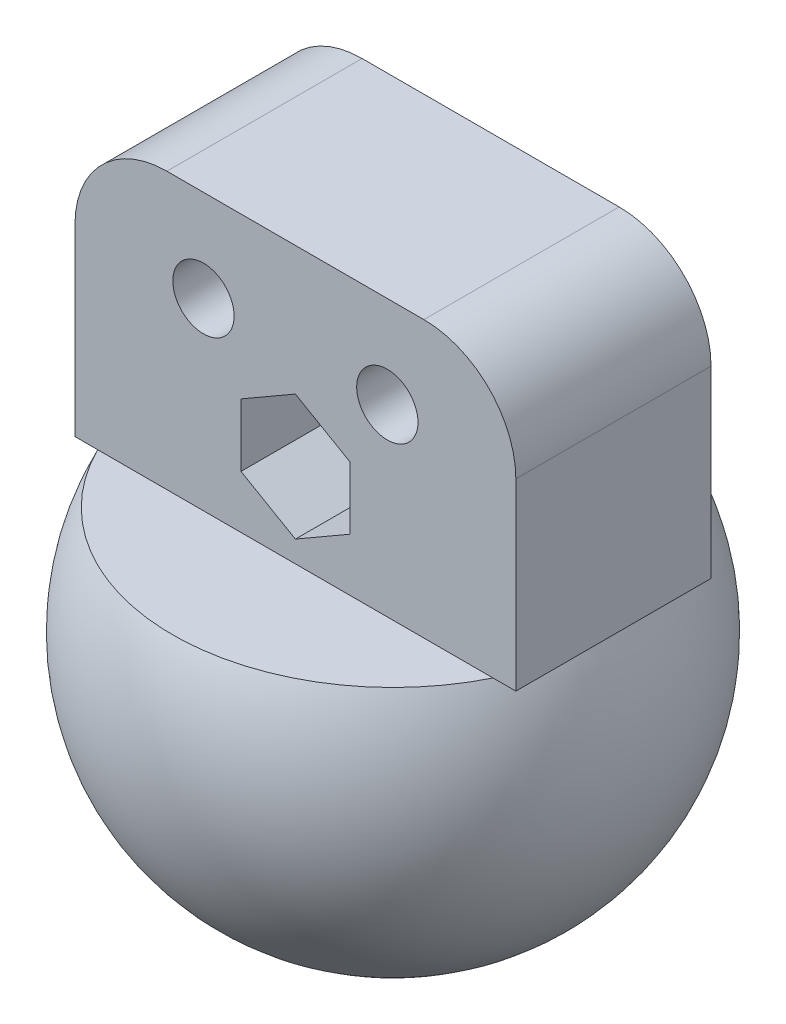
ISO-10303-21;
HEADER;
FILE_DESCRIPTION(('STEP AP214'),'2;1');
FILE_NAME('part.step','',(''),(''),'','','');
FILE_SCHEMA(('AUTOMOTIVE_DESIGN { 1 0 10303 214 1 1 1 1 }'));
ENDSEC;
DATA;
#1=APPLICATION_CONTEXT('core data for automotive mechanical design processes');
#2=APPLICATION_PROTOCOL_DEFINITION('international standard','automotive_design',2000,#1);
#3=PRODUCT_CONTEXT('',#1,'mechanical');
#4=PRODUCT('Part','Part','',(#3));
#5=PRODUCT_RELATED_PRODUCT_CATEGORY('part','',(#4));
#6=PRODUCT_DEFINITION_FORMATION('','',#4);
#7=PRODUCT_DEFINITION_CONTEXT('part definition',#1,'design');
#8=PRODUCT_DEFINITION('design','',#6,#7);
#9=PRODUCT_DEFINITION_SHAPE('','',#8);
#10=(LENGTH_UNIT() NAMED_UNIT(*) SI_UNIT(.MILLI.,.METRE.));
#11=(NAMED_UNIT(*) PLANE_ANGLE_UNIT() SI_UNIT($,.RADIAN.));
#12=(NAMED_UNIT(*) SI_UNIT($,.STERADIAN.) SOLID_ANGLE_UNIT());
#13=UNCERTAINTY_MEASURE_WITH_UNIT(LENGTH_MEASURE(1.E-05),#10,'distance_accuracy_value','');
#14=(GEOMETRIC_REPRESENTATION_CONTEXT(3) GLOBAL_UNCERTAINTY_ASSIGNED_CONTEXT((#13)) GLOBAL_UNIT_ASSIGNED_CONTEXT((#10,
#11,#12)) REPRESENTATION_CONTEXT('',''));
#15=CARTESIAN_POINT('',(0.,0.,0.));
#16=DIRECTION('',(0.,0.,1.));
#17=DIRECTION('',(1.,0.,0.));
#18=AXIS2_PLACEMENT_3D('',#15,#16,#17);
#19=CARTESIAN_POINT('',(0.,0.,0.));
#20=DIRECTION('',(0.,1.,0.));
#21=DIRECTION('',(1.,0.,0.));
#22=AXIS2_PLACEMENT_3D('',#19,#20,#21);
#23=SPHERICAL_SURFACE('',#22,16.);
#24=CARTESIAN_POINT('',(0.,7.,0.));
#25=DIRECTION('',(0.,1.,0.));
#26=DIRECTION('',(0.,0.,1.));
#27=AXIS2_PLACEMENT_3D('',#24,#25,#26);
#28=CIRCLE('',#27,14.3874945699382);
#29=CARTESIAN_POINT('',(-12.9005077419457,7.,-6.37));
#30=VERTEX_POINT('',#29);
#31=CARTESIAN_POINT('',(-14.3874945699382,7.,0.));
#32=VERTEX_POINT('',#31);
#33=EDGE_CURVE('E364',#30,#32,#28,.T.);
#34=ORIENTED_EDGE('',*,*,#33,.F.);
#35=CARTESIAN_POINT('',(0.,7.,0.));
#36=DIRECTION('',(0.,-1.,0.));
#37=DIRECTION('',(0.,0.,-1.));
#38=AXIS2_PLACEMENT_3D('',#35,#36,#37);
#39=CIRCLE('',#38,14.3874945699382);
#40=CARTESIAN_POINT('',(12.9005077419457,7.,-6.37));
#41=VERTEX_POINT('',#40);
#42=EDGE_CURVE('E199',#41,#30,#39,.F.);
#43=ORIENTED_EDGE('',*,*,#42,.F.);
#44=CARTESIAN_POINT('',(14.3874945699382,7.,0.));
#45=VERTEX_POINT('',#44);
#46=EDGE_CURVE('E276',#45,#41,#28,.T.);
#47=ORIENTED_EDGE('',*,*,#46,.F.);
#48=CARTESIAN_POINT('',(12.9005077419457,7.,6.37));
#49=VERTEX_POINT('',#48);
#50=EDGE_CURVE('E279',#49,#45,#28,.T.);
#51=ORIENTED_EDGE('',*,*,#50,.F.);
#52=CARTESIAN_POINT('',(0.,7.,0.));
#53=DIRECTION('',(0.,1.,0.));
#54=DIRECTION('',(0.,0.,1.));
#55=AXIS2_PLACEMENT_3D('',#52,#53,#54);
#56=CIRCLE('',#55,14.3874945699382);
#57=CARTESIAN_POINT('',(-12.9005077419457,7.,6.37));
#58=VERTEX_POINT('',#57);
#59=EDGE_CURVE('E209',#49,#58,#56,.F.);
#60=ORIENTED_EDGE('',*,*,#59,.T.);
#61=EDGE_CURVE('E280',#32,#58,#28,.T.);
#62=ORIENTED_EDGE('',*,*,#61,.F.);
#63=EDGE_LOOP('',(#34,#43,#47,#51,#60,#62));
#64=FACE_BOUND('',#63,.T.);
#65=ADVANCED_FACE('F62',(#64),#23,.T.);
#66=CARTESIAN_POINT('',(-14.3874945699382,7.,6.37));
#67=DIRECTION('',(0.,1.,0.));
#68=DIRECTION('',(0.,0.,1.));
#69=AXIS2_PLACEMENT_3D('',#66,#67,#68);
#70=PLANE('',#69);
#71=DIRECTION('',(1.,0.,0.));
#72=VECTOR('',#71,1.);
#73=CARTESIAN_POINT('',(-14.3874945699382,7.,6.37));
#74=LINE('',#73,#72);
#75=CARTESIAN_POINT('',(14.3874945699382,7.,6.37));
#76=VERTEX_POINT('',#75);
#77=EDGE_CURVE('E249',#49,#76,#74,.T.);
#78=ORIENTED_EDGE('',*,*,#77,.F.);
#79=ORIENTED_EDGE('',*,*,#50,.T.);
#80=DIRECTION('',(0.,0.,-1.));
#81=VECTOR('',#80,1.);
#82=CARTESIAN_POINT('',(14.3874945699382,7.,6.37));
#83=LINE('',#82,#81);
#84=EDGE_CURVE('E269',#76,#45,#83,.T.);
#85=ORIENTED_EDGE('',*,*,#84,.F.);
#86=EDGE_LOOP('',(#78,#79,#85));
#87=FACE_BOUND('',#86,.T.);
#88=ADVANCED_FACE('F325',(#87),#70,.F.);
#89=CARTESIAN_POINT('',(14.3874945699382,7.,-6.37));
#90=VERTEX_POINT('',#89);
#91=EDGE_CURVE('E259',#45,#90,#83,.T.);
#92=ORIENTED_EDGE('',*,*,#91,.F.);
#93=ORIENTED_EDGE('',*,*,#46,.T.);
#94=DIRECTION('',(1.,0.,0.));
#95=VECTOR('',#94,1.);
#96=CARTESIAN_POINT('',(-14.3874945699382,7.,-6.37));
#97=LINE('',#96,#95);
#98=EDGE_CURVE('E261',#41,#90,#97,.T.);
#99=ORIENTED_EDGE('',*,*,#98,.T.);
#100=EDGE_LOOP('',(#92,#93,#99));
#101=FACE_BOUND('',#100,.T.);
#102=ADVANCED_FACE('F331',(#101),#70,.F.);
#103=CARTESIAN_POINT('',(-14.3874945699382,7.,-6.37));
#104=VERTEX_POINT('',#103);
#105=EDGE_CURVE('E262',#104,#30,#97,.T.);
#106=ORIENTED_EDGE('',*,*,#105,.T.);
#107=ORIENTED_EDGE('',*,*,#33,.T.);
#108=DIRECTION('',(0.,0.,-1.));
#109=VECTOR('',#108,1.);
#110=CARTESIAN_POINT('',(-14.3874945699382,7.,6.37));
#111=LINE('',#110,#109);
#112=EDGE_CURVE('E272',#32,#104,#111,.T.);
#113=ORIENTED_EDGE('',*,*,#112,.T.);
#114=EDGE_LOOP('',(#106,#107,#113));
#115=FACE_BOUND('',#114,.T.);
#116=ADVANCED_FACE('F377',(#115),#70,.F.);
#117=CARTESIAN_POINT('',(-3.55,14.5495934556232,6.37));
#118=DIRECTION('',(1.,0.,0.));
#119=DIRECTION('',(0.,1.,0.));
#120=AXIS2_PLACEMENT_3D('',#117,#118,#119);
#121=PLANE('',#120);
#122=DIRECTION('',(0.,-1.,0.));
#123=VECTOR('',#122,1.);
#124=CARTESIAN_POINT('',(-3.55,14.5495934556232,6.37));
#125=LINE('',#124,#123);
#126=CARTESIAN_POINT('',(-3.55,14.5495934556232,6.37));
#127=VERTEX_POINT('',#126);
#128=CARTESIAN_POINT('',(-3.55,10.4504065443768,6.37));
#129=VERTEX_POINT('',#128);
#130=EDGE_CURVE('E172',#127,#129,#125,.T.);
#131=ORIENTED_EDGE('',*,*,#130,.T.);
#132=DIRECTION('',(0.,0.,1.));
#133=VECTOR('',#132,1.);
#134=CARTESIAN_POINT('',(-3.55,10.4504065443768,-16.));
#135=LINE('',#134,#133);
#136=CARTESIAN_POINT('',(-3.55,10.4504065443768,-6.37));
#137=VERTEX_POINT('',#136);
#138=EDGE_CURVE('E175',#137,#129,#135,.T.);
#139=ORIENTED_EDGE('',*,*,#138,.F.);
#140=DIRECTION('',(0.,-1.,0.));
#141=VECTOR('',#140,1.);
#142=CARTESIAN_POINT('',(-3.55,14.5495934556232,-6.37));
#143=LINE('',#142,#141);
#144=CARTESIAN_POINT('',(-3.55,14.5495934556232,-6.37));
#145=VERTEX_POINT('',#144);
#146=EDGE_CURVE('E77',#145,#137,#143,.T.);
#147=ORIENTED_EDGE('',*,*,#146,.F.);
#148=DIRECTION('',(0.,0.,-1.));
#149=VECTOR('',#148,1.);
#150=CARTESIAN_POINT('',(-3.55,14.5495934556232,6.37));
#151=LINE('',#150,#149);
#152=EDGE_CURVE('E177',#127,#145,#151,.T.);
#153=ORIENTED_EDGE('',*,*,#152,.F.);
#154=EDGE_LOOP('',(#131,#139,#147,#153));
#155=FACE_BOUND('',#154,.T.);
#156=ADVANCED_FACE('F174',(#155),#121,.T.);
#157=CARTESIAN_POINT('',(3.55,10.4504065443768,6.37));
#158=DIRECTION('',(-1.,0.,0.));
#159=DIRECTION('',(0.,-1.,0.));
#160=AXIS2_PLACEMENT_3D('',#157,#158,#159);
#161=PLANE('',#160);
#162=DIRECTION('',(0.,0.,-1.));
#163=VECTOR('',#162,1.);
#164=CARTESIAN_POINT('',(3.55,14.5495934556232,6.37));
#165=LINE('',#164,#163);
#166=CARTESIAN_POINT('',(3.55,14.5495934556232,6.37));
#167=VERTEX_POINT('',#166);
#168=CARTESIAN_POINT('',(3.55,14.5495934556232,-6.37));
#169=VERTEX_POINT('',#168);
#170=EDGE_CURVE('E221',#167,#169,#165,.T.);
#171=ORIENTED_EDGE('',*,*,#170,.T.);
#172=DIRECTION('',(0.,1.,0.));
#173=VECTOR('',#172,1.);
#174=CARTESIAN_POINT('',(3.55,10.4504065443768,-6.37));
#175=LINE('',#174,#173);
#176=CARTESIAN_POINT('',(3.55,10.4504065443768,-6.37));
#177=VERTEX_POINT('',#176);
#178=EDGE_CURVE('E218',#177,#169,#175,.T.);
#179=ORIENTED_EDGE('',*,*,#178,.F.);
#180=DIRECTION('',(0.,0.,1.));
#181=VECTOR('',#180,1.);
#182=CARTESIAN_POINT('',(3.55,10.4504065443768,-16.));
#183=LINE('',#182,#181);
#184=CARTESIAN_POINT('',(3.55,10.4504065443768,6.37));
#185=VERTEX_POINT('',#184);
#186=EDGE_CURVE('E197',#177,#185,#183,.T.);
#187=ORIENTED_EDGE('',*,*,#186,.T.);
#188=DIRECTION('',(0.,1.,0.));
#189=VECTOR('',#188,1.);
#190=CARTESIAN_POINT('',(3.55,10.4504065443768,6.37));
#191=LINE('',#190,#189);
#192=EDGE_CURVE('E182',#185,#167,#191,.T.);
#193=ORIENTED_EDGE('',*,*,#192,.T.);
#194=EDGE_LOOP('',(#171,#179,#187,#193));
#195=FACE_BOUND('',#194,.T.);
#196=ADVANCED_FACE('F303',(#195),#161,.T.);
#197=CARTESIAN_POINT('',(0.,0.,6.37));
#198=DIRECTION('',(0.,0.,1.));
#199=DIRECTION('',(1.,0.,0.));
#200=AXIS2_PLACEMENT_3D('',#197,#198,#199);
#201=PLANE('',#200);
#202=ORIENTED_EDGE('',*,*,#192,.F.);
#203=DIRECTION('',(0.866025403784438,0.5,0.));
#204=VECTOR('',#203,1.);
#205=CARTESIAN_POINT('',(-3.63765877365274,6.30060981656524,6.37));
#206=LINE('',#205,#204);
#207=CARTESIAN_POINT('',(0.,8.40081308875366,6.37));
#208=VERTEX_POINT('',#207);
#209=EDGE_CURVE('E196',#208,#185,#206,.T.);
#210=ORIENTED_EDGE('',*,*,#209,.F.);
#211=DIRECTION('',(0.866025403784439,-0.5,0.));
#212=VECTOR('',#211,1.);
#213=CARTESIAN_POINT('',(3.63765877365274,6.30060981656524,6.37));
#214=LINE('',#213,#212);
#215=EDGE_CURVE('E188',#129,#208,#214,.T.);
#216=ORIENTED_EDGE('',*,*,#215,.F.);
#217=ORIENTED_EDGE('',*,*,#130,.F.);
#218=DIRECTION('',(-0.866025403784438,-0.5,0.));
#219=VECTOR('',#218,1.);
#220=CARTESIAN_POINT('',(0.,16.5991869112463,6.37));
#221=LINE('',#220,#219);
#222=CARTESIAN_POINT('',(0.,16.5991869112463,6.37));
#223=VERTEX_POINT('',#222);
#224=EDGE_CURVE('E183',#223,#127,#221,.T.);
#225=ORIENTED_EDGE('',*,*,#224,.F.);
#226=DIRECTION('',(-0.866025403784439,0.5,0.));
#227=VECTOR('',#226,1.);
#228=CARTESIAN_POINT('',(3.55,14.5495934556232,6.37));
#229=LINE('',#228,#227);
#230=EDGE_CURVE('E216',#167,#223,#229,.T.);
#231=ORIENTED_EDGE('',*,*,#230,.F.);
#232=EDGE_LOOP('',(#202,#210,#216,#217,#225,#231));
#233=FACE_BOUND('',#232,.T.);
#234=DIRECTION('',(-1.,0.,0.));
#235=VECTOR('',#234,1.);
#236=CARTESIAN_POINT('',(-14.3874945699382,25.,6.37));
#237=LINE('',#236,#235);
#238=CARTESIAN_POINT('',(8.38749456993816,25.,6.37));
#239=VERTEX_POINT('',#238);
#240=CARTESIAN_POINT('',(-8.38749456993816,25.,6.37));
#241=VERTEX_POINT('',#240);
#242=EDGE_CURVE('E256',#239,#241,#237,.T.);
#243=ORIENTED_EDGE('',*,*,#242,.T.);
#244=CARTESIAN_POINT('',(-8.38749456993816,19.,6.37));
#245=DIRECTION('',(0.,0.,1.));
#246=DIRECTION('',(1.,0.,0.));
#247=AXIS2_PLACEMENT_3D('',#244,#245,#246);
#248=CIRCLE('',#247,6.);
#249=CARTESIAN_POINT('',(-14.3874945699382,19.,6.37));
#250=VERTEX_POINT('',#249);
#251=EDGE_CURVE('E295',#241,#250,#248,.T.);
#252=ORIENTED_EDGE('',*,*,#251,.T.);
#253=DIRECTION('',(0.,-1.,0.));
#254=VECTOR('',#253,1.);
#255=CARTESIAN_POINT('',(-14.3874945699382,25.,6.37));
#256=LINE('',#255,#254);
#257=CARTESIAN_POINT('',(-14.3874945699382,7.,6.37));
#258=VERTEX_POINT('',#257);
#259=EDGE_CURVE('E247',#250,#258,#256,.T.);
#260=ORIENTED_EDGE('',*,*,#259,.T.);
#261=EDGE_CURVE('E251',#258,#58,#74,.T.);
#262=ORIENTED_EDGE('',*,*,#261,.T.);
#263=DIRECTION('',(1.,0.,0.));
#264=VECTOR('',#263,1.);
#265=CARTESIAN_POINT('',(-14.3874945699382,7.,6.37));
#266=LINE('',#265,#264);
#267=EDGE_CURVE('E212',#58,#49,#266,.T.);
#268=ORIENTED_EDGE('',*,*,#267,.T.);
#269=ORIENTED_EDGE('',*,*,#77,.T.);
#270=DIRECTION('',(0.,1.,0.));
#271=VECTOR('',#270,1.);
#272=CARTESIAN_POINT('',(14.3874945699382,25.,6.37));
#273=LINE('',#272,#271);
#274=CARTESIAN_POINT('',(14.3874945699382,19.,6.37));
#275=VERTEX_POINT('',#274);
#276=EDGE_CURVE('E254',#76,#275,#273,.T.);
#277=ORIENTED_EDGE('',*,*,#276,.T.);
#278=CARTESIAN_POINT('',(8.38749456993816,19.,6.37));
#279=DIRECTION('',(0.,0.,1.));
#280=DIRECTION('',(1.,0.,0.));
#281=AXIS2_PLACEMENT_3D('',#278,#279,#280);
#282=CIRCLE('',#281,6.);
#283=EDGE_CURVE('E293',#275,#239,#282,.T.);
#284=ORIENTED_EDGE('',*,*,#283,.T.);
#285=EDGE_LOOP('',(#243,#252,#260,#262,#268,#269,#277,#284));
#286=FACE_BOUND('',#285,.T.);
#287=CARTESIAN_POINT('',(6.,19.,6.37));
#288=DIRECTION('',(0.,0.,1.));
#289=DIRECTION('',(1.,0.,0.));
#290=AXIS2_PLACEMENT_3D('',#287,#288,#289);
#291=CIRCLE('',#290,2.);
#292=CARTESIAN_POINT('',(8.,19.,6.37));
#293=VERTEX_POINT('',#292);
#294=EDGE_CURVE('E241',#293,#293,#291,.T.);
#295=ORIENTED_EDGE('',*,*,#294,.F.);
#296=EDGE_LOOP('',(#295));
#297=FACE_BOUND('',#296,.T.);
#298=CARTESIAN_POINT('',(-6.,19.,6.37));
#299=DIRECTION('',(0.,0.,1.));
#300=DIRECTION('',(1.,0.,0.));
#301=AXIS2_PLACEMENT_3D('',#298,#299,#300);
#302=CIRCLE('',#301,2.);
#303=CARTESIAN_POINT('',(-4.,19.,6.37));
#304=VERTEX_POINT('',#303);
#305=EDGE_CURVE('E235',#304,#304,#302,.T.);
#306=ORIENTED_EDGE('',*,*,#305,.F.);
#307=EDGE_LOOP('',(#306));
#308=FACE_BOUND('',#307,.T.);
#309=ADVANCED_FACE('F193',(#233,#286,#297,#308),#201,.T.);
#310=CARTESIAN_POINT('',(0.,0.,-6.37));
#311=DIRECTION('',(0.,0.,1.));
#312=DIRECTION('',(1.,0.,0.));
#313=AXIS2_PLACEMENT_3D('',#310,#311,#312);
#314=PLANE('',#313);
#315=DIRECTION('',(0.,-1.,0.));
#316=VECTOR('',#315,1.);
#317=CARTESIAN_POINT('',(-14.3874945699382,25.,-6.37));
#318=LINE('',#317,#316);
#319=CARTESIAN_POINT('',(-14.3874945699382,19.,-6.37));
#320=VERTEX_POINT('',#319);
#321=EDGE_CURVE('E244',#320,#104,#318,.T.);
#322=ORIENTED_EDGE('',*,*,#321,.F.);
#323=CARTESIAN_POINT('',(-8.38749456993816,19.,-6.37));
#324=DIRECTION('',(0.,0.,1.));
#325=DIRECTION('',(1.,0.,0.));
#326=AXIS2_PLACEMENT_3D('',#323,#324,#325);
#327=CIRCLE('',#326,6.);
#328=CARTESIAN_POINT('',(-8.38749456993816,25.,-6.37));
#329=VERTEX_POINT('',#328);
#330=EDGE_CURVE('E286',#320,#329,#327,.F.);
#331=ORIENTED_EDGE('',*,*,#330,.T.);
#332=DIRECTION('',(-1.,0.,0.));
#333=VECTOR('',#332,1.);
#334=CARTESIAN_POINT('',(-14.3874945699382,25.,-6.37));
#335=LINE('',#334,#333);
#336=CARTESIAN_POINT('',(8.38749456993816,25.,-6.37));
#337=VERTEX_POINT('',#336);
#338=EDGE_CURVE('E250',#337,#329,#335,.T.);
#339=ORIENTED_EDGE('',*,*,#338,.F.);
#340=CARTESIAN_POINT('',(8.38749456993816,19.,-6.37));
#341=DIRECTION('',(0.,0.,1.));
#342=DIRECTION('',(1.,0.,0.));
#343=AXIS2_PLACEMENT_3D('',#340,#341,#342);
#344=CIRCLE('',#343,6.);
#345=CARTESIAN_POINT('',(14.3874945699382,19.,-6.37));
#346=VERTEX_POINT('',#345);
#347=EDGE_CURVE('E284',#337,#346,#344,.F.);
#348=ORIENTED_EDGE('',*,*,#347,.T.);
#349=DIRECTION('',(0.,1.,0.));
#350=VECTOR('',#349,1.);
#351=CARTESIAN_POINT('',(14.3874945699382,25.,-6.37));
#352=LINE('',#351,#350);
#353=EDGE_CURVE('E265',#90,#346,#352,.T.);
#354=ORIENTED_EDGE('',*,*,#353,.F.);
#355=ORIENTED_EDGE('',*,*,#98,.F.);
#356=DIRECTION('',(1.,0.,0.));
#357=VECTOR('',#356,1.);
#358=CARTESIAN_POINT('',(0.,7.,-6.37));
#359=LINE('',#358,#357);
#360=EDGE_CURVE('E207',#30,#41,#359,.T.);
#361=ORIENTED_EDGE('',*,*,#360,.F.);
#362=ORIENTED_EDGE('',*,*,#105,.F.);
#363=EDGE_LOOP('',(#322,#331,#339,#348,#354,#355,#361,#362));
#364=FACE_BOUND('',#363,.T.);
#365=CARTESIAN_POINT('',(-6.,19.,-6.37));
#366=DIRECTION('',(0.,0.,1.));
#367=DIRECTION('',(1.,0.,0.));
#368=AXIS2_PLACEMENT_3D('',#365,#366,#367);
#369=CIRCLE('',#368,2.);
#370=CARTESIAN_POINT('',(-4.,19.,-6.37));
#371=VERTEX_POINT('',#370);
#372=EDGE_CURVE('E234',#371,#371,#369,.T.);
#373=ORIENTED_EDGE('',*,*,#372,.T.);
#374=EDGE_LOOP('',(#373));
#375=FACE_BOUND('',#374,.T.);
#376=CARTESIAN_POINT('',(6.,19.,-6.37));
#377=DIRECTION('',(0.,0.,1.));
#378=DIRECTION('',(1.,0.,0.));
#379=AXIS2_PLACEMENT_3D('',#376,#377,#378);
#380=CIRCLE('',#379,2.);
#381=CARTESIAN_POINT('',(8.,19.,-6.37));
#382=VERTEX_POINT('',#381);
#383=EDGE_CURVE('E238',#382,#382,#380,.T.);
#384=ORIENTED_EDGE('',*,*,#383,.T.);
#385=EDGE_LOOP('',(#384));
#386=FACE_BOUND('',#385,.T.);
#387=DIRECTION('',(0.866025403784438,0.5,0.));
#388=VECTOR('',#387,1.);
#389=CARTESIAN_POINT('',(-3.63765877365274,6.30060981656524,-6.37));
#390=LINE('',#389,#388);
#391=CARTESIAN_POINT('',(0.,8.40081308875366,-6.37));
#392=VERTEX_POINT('',#391);
#393=EDGE_CURVE('E12',#392,#177,#390,.T.);
#394=ORIENTED_EDGE('',*,*,#393,.T.);
#395=ORIENTED_EDGE('',*,*,#178,.T.);
#396=DIRECTION('',(-0.866025403784439,0.5,0.));
#397=VECTOR('',#396,1.);
#398=CARTESIAN_POINT('',(3.55,14.5495934556232,-6.37));
#399=LINE('',#398,#397);
#400=CARTESIAN_POINT('',(0.,16.5991869112463,-6.37));
#401=VERTEX_POINT('',#400);
#402=EDGE_CURVE('E215',#169,#401,#399,.T.);
#403=ORIENTED_EDGE('',*,*,#402,.T.);
#404=DIRECTION('',(-0.866025403784438,-0.5,0.));
#405=VECTOR('',#404,1.);
#406=CARTESIAN_POINT('',(0.,16.5991869112463,-6.37));
#407=LINE('',#406,#405);
#408=EDGE_CURVE('E224',#401,#145,#407,.T.);
#409=ORIENTED_EDGE('',*,*,#408,.T.);
#410=ORIENTED_EDGE('',*,*,#146,.T.);
#411=DIRECTION('',(0.866025403784439,-0.5,0.));
#412=VECTOR('',#411,1.);
#413=CARTESIAN_POINT('',(3.63765877365274,6.30060981656524,-6.37));
#414=LINE('',#413,#412);
#415=EDGE_CURVE('E70',#137,#392,#414,.T.);
#416=ORIENTED_EDGE('',*,*,#415,.T.);
#417=EDGE_LOOP('',(#394,#395,#403,#409,#410,#416));
#418=FACE_BOUND('',#417,.T.);
#419=ADVANCED_FACE('F297',(#364,#375,#386,#418),#314,.F.);
#420=CARTESIAN_POINT('',(-14.3874945699382,25.,6.37));
#421=DIRECTION('',(1.,0.,0.));
#422=DIRECTION('',(0.,1.,0.));
#423=AXIS2_PLACEMENT_3D('',#420,#421,#422);
#424=PLANE('',#423);
#425=ORIENTED_EDGE('',*,*,#259,.F.);
#426=DIRECTION('',(0.,0.,-1.));
#427=VECTOR('',#426,1.);
#428=CARTESIAN_POINT('',(-14.3874945699382,19.,6.37));
#429=LINE('',#428,#427);
#430=EDGE_CURVE('E281',#250,#320,#429,.T.);
#431=ORIENTED_EDGE('',*,*,#430,.T.);
#432=ORIENTED_EDGE('',*,*,#321,.T.);
#433=ORIENTED_EDGE('',*,*,#112,.F.);
#434=EDGE_CURVE('E273',#258,#32,#111,.T.);
#435=ORIENTED_EDGE('',*,*,#434,.F.);
#436=EDGE_LOOP('',(#425,#431,#432,#433,#435));
#437=FACE_BOUND('',#436,.T.);
#438=ADVANCED_FACE('F337',(#437),#424,.F.);
#439=ORIENTED_EDGE('',*,*,#434,.T.);
#440=ORIENTED_EDGE('',*,*,#61,.T.);
#441=ORIENTED_EDGE('',*,*,#261,.F.);
#442=EDGE_LOOP('',(#439,#440,#441));
#443=FACE_BOUND('',#442,.T.);
#444=ADVANCED_FACE('F334',(#443),#70,.F.);
#445=CARTESIAN_POINT('',(14.3874945699382,25.,6.37));
#446=DIRECTION('',(-1.,0.,0.));
#447=DIRECTION('',(0.,-1.,0.));
#448=AXIS2_PLACEMENT_3D('',#445,#446,#447);
#449=PLANE('',#448);
#450=ORIENTED_EDGE('',*,*,#353,.T.);
#451=DIRECTION('',(0.,0.,-1.));
#452=VECTOR('',#451,1.);
#453=CARTESIAN_POINT('',(14.3874945699382,19.,6.37));
#454=LINE('',#453,#452);
#455=EDGE_CURVE('E85',#346,#275,#454,.F.);
#456=ORIENTED_EDGE('',*,*,#455,.T.);
#457=ORIENTED_EDGE('',*,*,#276,.F.);
#458=ORIENTED_EDGE('',*,*,#84,.T.);
#459=ORIENTED_EDGE('',*,*,#91,.T.);
#460=EDGE_LOOP('',(#450,#456,#457,#458,#459));
#461=FACE_BOUND('',#460,.T.);
#462=ADVANCED_FACE('F375',(#461),#449,.F.);
#463=CARTESIAN_POINT('',(-14.3874945699382,25.,6.37));
#464=DIRECTION('',(0.,-1.,0.));
#465=DIRECTION('',(0.,0.,-1.));
#466=AXIS2_PLACEMENT_3D('',#463,#464,#465);
#467=PLANE('',#466);
#468=ORIENTED_EDGE('',*,*,#338,.T.);
#469=DIRECTION('',(0.,0.,-1.));
#470=VECTOR('',#469,1.);
#471=CARTESIAN_POINT('',(-8.38749456993816,25.,6.37));
#472=LINE('',#471,#470);
#473=EDGE_CURVE('E291',#329,#241,#472,.F.);
#474=ORIENTED_EDGE('',*,*,#473,.T.);
#475=ORIENTED_EDGE('',*,*,#242,.F.);
#476=DIRECTION('',(0.,0.,-1.));
#477=VECTOR('',#476,1.);
#478=CARTESIAN_POINT('',(8.38749456993816,25.,6.37));
#479=LINE('',#478,#477);
#480=EDGE_CURVE('E288',#239,#337,#479,.T.);
#481=ORIENTED_EDGE('',*,*,#480,.T.);
#482=EDGE_LOOP('',(#468,#474,#475,#481));
#483=FACE_BOUND('',#482,.T.);
#484=ADVANCED_FACE('F384',(#483),#467,.F.);
#485=CARTESIAN_POINT('',(6.,19.,6.37));
#486=DIRECTION('',(0.,0.,-1.));
#487=DIRECTION('',(-1.,0.,0.));
#488=AXIS2_PLACEMENT_3D('',#485,#486,#487);
#489=CYLINDRICAL_SURFACE('',#488,2.);
#490=ORIENTED_EDGE('',*,*,#294,.T.);
#491=EDGE_LOOP('',(#490));
#492=FACE_BOUND('',#491,.T.);
#493=ORIENTED_EDGE('',*,*,#383,.F.);
#494=EDGE_LOOP('',(#493));
#495=FACE_BOUND('',#494,.T.);
#496=ADVANCED_FACE('F386',(#492,#495),#489,.F.);
#497=CARTESIAN_POINT('',(-6.,19.,6.37));
#498=DIRECTION('',(0.,0.,-1.));
#499=DIRECTION('',(-1.,0.,0.));
#500=AXIS2_PLACEMENT_3D('',#497,#498,#499);
#501=CYLINDRICAL_SURFACE('',#500,2.);
#502=ORIENTED_EDGE('',*,*,#305,.T.);
#503=EDGE_LOOP('',(#502));
#504=FACE_BOUND('',#503,.T.);
#505=ORIENTED_EDGE('',*,*,#372,.F.);
#506=EDGE_LOOP('',(#505));
#507=FACE_BOUND('',#506,.T.);
#508=ADVANCED_FACE('F321',(#504,#507),#501,.F.);
#509=CARTESIAN_POINT('',(3.55,14.5495934556232,6.37));
#510=DIRECTION('',(-0.5,-0.866025403784439,0.));
#511=DIRECTION('',(0.866025403784439,-0.5,0.));
#512=AXIS2_PLACEMENT_3D('',#509,#510,#511);
#513=PLANE('',#512);
#514=ORIENTED_EDGE('',*,*,#402,.F.);
#515=ORIENTED_EDGE('',*,*,#170,.F.);
#516=ORIENTED_EDGE('',*,*,#230,.T.);
#517=DIRECTION('',(0.,0.,-1.));
#518=VECTOR('',#517,1.);
#519=CARTESIAN_POINT('',(0.,16.5991869112463,6.37));
#520=LINE('',#519,#518);
#521=EDGE_CURVE('E231',#223,#401,#520,.T.);
#522=ORIENTED_EDGE('',*,*,#521,.T.);
#523=EDGE_LOOP('',(#514,#515,#516,#522));
#524=FACE_BOUND('',#523,.T.);
#525=ADVANCED_FACE('F307',(#524),#513,.T.);
#526=CARTESIAN_POINT('',(0.,16.5991869112463,6.37));
#527=DIRECTION('',(0.5,-0.866025403784438,0.));
#528=DIRECTION('',(0.866025403784439,0.5,0.));
#529=AXIS2_PLACEMENT_3D('',#526,#527,#528);
#530=PLANE('',#529);
#531=ORIENTED_EDGE('',*,*,#224,.T.);
#532=ORIENTED_EDGE('',*,*,#152,.T.);
#533=ORIENTED_EDGE('',*,*,#408,.F.);
#534=ORIENTED_EDGE('',*,*,#521,.F.);
#535=EDGE_LOOP('',(#531,#532,#533,#534));
#536=FACE_BOUND('',#535,.T.);
#537=ADVANCED_FACE('F310',(#536),#530,.T.);
#538=CARTESIAN_POINT('',(-14.3874945699382,7.,16.001));
#539=DIRECTION('',(0.,1.,0.));
#540=DIRECTION('',(0.,0.,1.));
#541=AXIS2_PLACEMENT_3D('',#538,#539,#540);
#542=PLANE('',#541);
#543=ORIENTED_EDGE('',*,*,#267,.F.);
#544=ORIENTED_EDGE('',*,*,#59,.F.);
#545=EDGE_LOOP('',(#543,#544));
#546=FACE_BOUND('',#545,.T.);
#547=ADVANCED_FACE('F312',(#546),#542,.T.);
#548=CARTESIAN_POINT('',(0.,7.,-16.001));
#549=DIRECTION('',(0.,-1.,0.));
#550=DIRECTION('',(0.,0.,-1.));
#551=AXIS2_PLACEMENT_3D('',#548,#549,#550);
#552=PLANE('',#551);
#553=ORIENTED_EDGE('',*,*,#42,.T.);
#554=ORIENTED_EDGE('',*,*,#360,.T.);
#555=EDGE_LOOP('',(#553,#554));
#556=FACE_BOUND('',#555,.T.);
#557=ADVANCED_FACE('F318',(#556),#552,.F.);
#558=CARTESIAN_POINT('',(-8.38749456993816,19.,6.37));
#559=DIRECTION('',(0.,0.,-1.));
#560=DIRECTION('',(-1.,0.,0.));
#561=AXIS2_PLACEMENT_3D('',#558,#559,#560);
#562=CYLINDRICAL_SURFACE('',#561,6.);
#563=ORIENTED_EDGE('',*,*,#251,.F.);
#564=ORIENTED_EDGE('',*,*,#473,.F.);
#565=ORIENTED_EDGE('',*,*,#330,.F.);
#566=ORIENTED_EDGE('',*,*,#430,.F.);
#567=EDGE_LOOP('',(#563,#564,#565,#566));
#568=FACE_BOUND('',#567,.T.);
#569=ADVANCED_FACE('F338',(#568),#562,.T.);
#570=CARTESIAN_POINT('',(8.38749456993816,19.,6.37));
#571=DIRECTION('',(0.,0.,-1.));
#572=DIRECTION('',(-1.,0.,0.));
#573=AXIS2_PLACEMENT_3D('',#570,#571,#572);
#574=CYLINDRICAL_SURFACE('',#573,6.);
#575=ORIENTED_EDGE('',*,*,#283,.F.);
#576=ORIENTED_EDGE('',*,*,#455,.F.);
#577=ORIENTED_EDGE('',*,*,#347,.F.);
#578=ORIENTED_EDGE('',*,*,#480,.F.);
#579=EDGE_LOOP('',(#575,#576,#577,#578));
#580=FACE_BOUND('',#579,.T.);
#581=ADVANCED_FACE('F64',(#580),#574,.T.);
#582=CARTESIAN_POINT('',(0.,8.40081308875366,-16.));
#583=DIRECTION('',(0.5,-0.866025403784438,0.));
#584=DIRECTION('',(0.866025403784438,0.5,0.));
#585=AXIS2_PLACEMENT_3D('',#582,#583,#584);
#586=PLANE('',#585);
#587=ORIENTED_EDGE('',*,*,#209,.T.);
#588=ORIENTED_EDGE('',*,*,#186,.F.);
#589=ORIENTED_EDGE('',*,*,#393,.F.);
#590=DIRECTION('',(0.,0.,1.));
#591=VECTOR('',#590,1.);
#592=CARTESIAN_POINT('',(0.,8.40081308875366,-16.));
#593=LINE('',#592,#591);
#594=EDGE_CURVE('E190',#392,#208,#593,.T.);
#595=ORIENTED_EDGE('',*,*,#594,.T.);
#596=EDGE_LOOP('',(#587,#588,#589,#595));
#597=FACE_BOUND('',#596,.T.);
#598=ADVANCED_FACE('F301',(#597),#586,.F.);
#599=CARTESIAN_POINT('',(-3.55,10.4504065443768,-16.));
#600=DIRECTION('',(-0.5,-0.866025403784439,0.));
#601=DIRECTION('',(0.866025403784439,-0.5,0.));
#602=AXIS2_PLACEMENT_3D('',#599,#600,#601);
#603=PLANE('',#602);
#604=ORIENTED_EDGE('',*,*,#215,.T.);
#605=ORIENTED_EDGE('',*,*,#594,.F.);
#606=ORIENTED_EDGE('',*,*,#415,.F.);
#607=ORIENTED_EDGE('',*,*,#138,.T.);
#608=EDGE_LOOP('',(#604,#605,#606,#607));
#609=FACE_BOUND('',#608,.T.);
#610=ADVANCED_FACE('F186',(#609),#603,.F.);
#611=CLOSED_SHELL('',(#65,#88,#102,#116,#156,#196,#309,#419,#438,#444,#462,#484,#496,#508,#525,
#537,#547,#557,#569,#581,#598,#610));
#612=MANIFOLD_SOLID_BREP('B2',#611);
#613=ADVANCED_BREP_SHAPE_REPRESENTATION('',(#18,#612),#14);
#614=SHAPE_DEFINITION_REPRESENTATION(#9,#613);
ENDSEC;
END-ISO-10303-21;
